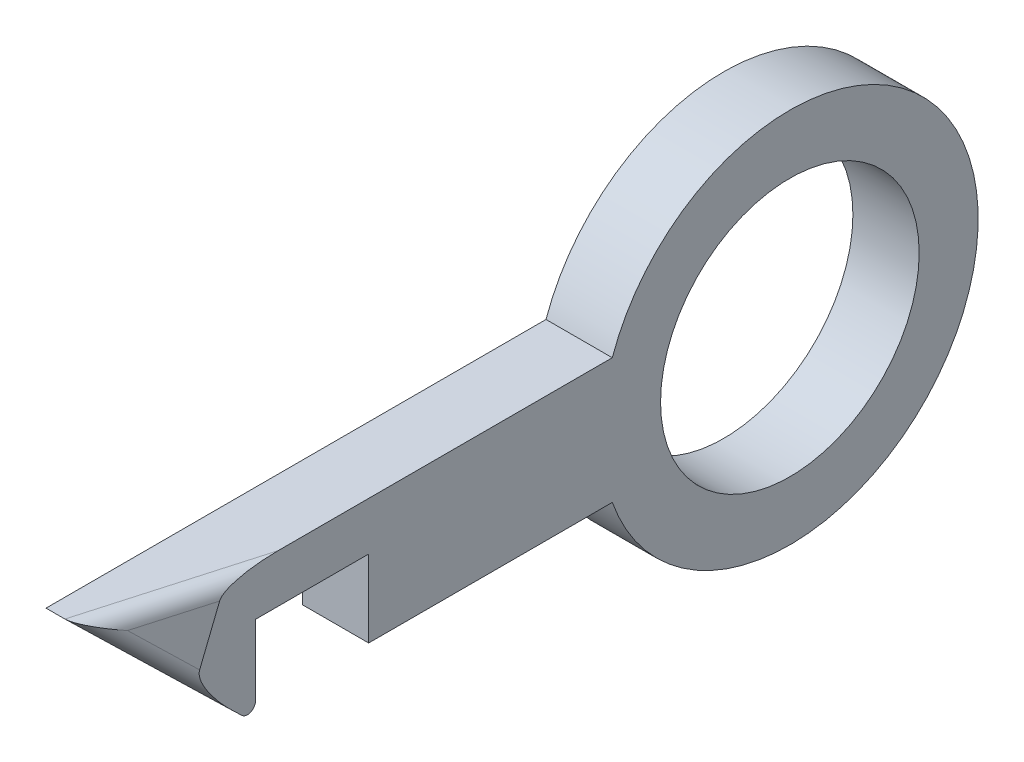
ISO-10303-21;
HEADER;
FILE_DESCRIPTION(('STEP AP214'),'2;1');
FILE_NAME('part.step','',(''),(''),'','','');
FILE_SCHEMA(('AUTOMOTIVE_DESIGN { 1 0 10303 214 1 1 1 1 }'));
ENDSEC;
DATA;
#1=APPLICATION_CONTEXT('core data for automotive mechanical design processes');
#2=APPLICATION_PROTOCOL_DEFINITION('international standard','automotive_design',2000,#1);
#3=PRODUCT_CONTEXT('',#1,'mechanical');
#4=PRODUCT('Part','Part','',(#3));
#5=PRODUCT_RELATED_PRODUCT_CATEGORY('part','',(#4));
#6=PRODUCT_DEFINITION_FORMATION('','',#4);
#7=PRODUCT_DEFINITION_CONTEXT('part definition',#1,'design');
#8=PRODUCT_DEFINITION('design','',#6,#7);
#9=PRODUCT_DEFINITION_SHAPE('','',#8);
#10=(LENGTH_UNIT() NAMED_UNIT(*) SI_UNIT(.MILLI.,.METRE.));
#11=(NAMED_UNIT(*) PLANE_ANGLE_UNIT() SI_UNIT($,.RADIAN.));
#12=(NAMED_UNIT(*) SI_UNIT($,.STERADIAN.) SOLID_ANGLE_UNIT());
#13=UNCERTAINTY_MEASURE_WITH_UNIT(LENGTH_MEASURE(1.E-05),#10,'distance_accuracy_value','');
#14=(GEOMETRIC_REPRESENTATION_CONTEXT(3) GLOBAL_UNCERTAINTY_ASSIGNED_CONTEXT((#13)) GLOBAL_UNIT_ASSIGNED_CONTEXT((#10,
#11,#12)) REPRESENTATION_CONTEXT('',''));
#15=CARTESIAN_POINT('',(0.,0.,0.));
#16=DIRECTION('',(0.,0.,1.));
#17=DIRECTION('',(1.,0.,0.));
#18=AXIS2_PLACEMENT_3D('',#15,#16,#17);
#19=CARTESIAN_POINT('',(4.1,4.64490969657858,-33.048252553421));
#20=DIRECTION('',(1.,0.,0.));
#21=DIRECTION('',(0.,0.,-1.));
#22=AXIS2_PLACEMENT_3D('',#19,#20,#21);
#23=PLANE('',#22);
#24=CARTESIAN_POINT('',(4.1,4.64490969657858,-33.048252553421));
#25=DIRECTION('',(1.,0.,0.));
#26=DIRECTION('',(0.,0.,-1.));
#27=AXIS2_PLACEMENT_3D('',#24,#25,#26);
#28=CIRCLE('',#27,8.);
#29=CARTESIAN_POINT('',(4.1,4.64490969657858,-41.048252553421));
#30=VERTEX_POINT('',#29);
#31=EDGE_CURVE('E238',#30,#30,#28,.T.);
#32=ORIENTED_EDGE('',*,*,#31,.F.);
#33=EDGE_LOOP('',(#32));
#34=FACE_BOUND('',#33,.T.);
#35=DIRECTION('',(0.,0.,1.));
#36=VECTOR('',#35,1.);
#37=CARTESIAN_POINT('',(4.1,8.51930515444542,8.86983730130517));
#38=LINE('',#37,#36);
#39=CARTESIAN_POINT('',(4.1,8.51930515444542,-22.061371292751));
#40=VERTEX_POINT('',#39);
#41=CARTESIAN_POINT('',(4.1,8.51930515444542,-1.38971479190022));
#42=VERTEX_POINT('',#41);
#43=EDGE_CURVE('E172',#40,#42,#38,.T.);
#44=ORIENTED_EDGE('',*,*,#43,.T.);
#45=CARTESIAN_POINT('',(4.1,7.51930515444542,-1.38971479190021));
#46=DIRECTION('',(1.,0.,0.));
#47=DIRECTION('',(0.,0.,-1.));
#48=AXIS2_PLACEMENT_3D('',#45,#46,#47);
#49=ELLIPSE('',#48,3.64005494464026,1.);
#50=CARTESIAN_POINT('',(4.1,7.62926768246086,2.22826588967206));
#51=VERTEX_POINT('',#50);
#52=EDGE_CURVE('E51',#42,#51,#49,.T.);
#53=ORIENTED_EDGE('',*,*,#52,.T.);
#54=DIRECTION('',(0.,-0.927606751707262,0.373558180458014));
#55=VECTOR('',#54,1.);
#56=CARTESIAN_POINT('',(4.1,17.2852100385916,-1.66029599339408));
#57=LINE('',#56,#55);
#58=CARTESIAN_POINT('',(4.1,4.55813136155333,3.46504871155776));
#59=VERTEX_POINT('',#58);
#60=EDGE_CURVE('E159',#51,#59,#57,.T.);
#61=ORIENTED_EDGE('',*,*,#60,.T.);
#62=CARTESIAN_POINT('',(4.1,2.13003448505021,0.780608075575374));
#63=DIRECTION('',(1.,0.,0.));
#64=DIRECTION('',(0.,0.693030180696668,0.720908571625795));
#65=AXIS2_PLACEMENT_3D('',#62,#63,#64);
#66=ELLIPSE('',#65,3.64005494464026,1.);
#67=CARTESIAN_POINT('',(4.1,1.40912591342442,1.47363825627204));
#68=VERTEX_POINT('',#67);
#69=EDGE_CURVE('E58',#59,#68,#66,.T.);
#70=ORIENTED_EDGE('',*,*,#69,.T.);
#71=DIRECTION('',(0.,-0.693030180696668,-0.720908571625795));
#72=VECTOR('',#71,1.);
#73=CARTESIAN_POINT('',(4.1,0.000360070989405065,0.00820226298800781));
#74=LINE('',#73,#72);
#75=CARTESIAN_POINT('',(4.1,0.814139417104715,0.854717353336342));
#76=VERTEX_POINT('',#75);
#77=EDGE_CURVE('E245',#68,#76,#74,.T.);
#78=ORIENTED_EDGE('',*,*,#77,.T.);
#79=CARTESIAN_POINT('',(4.1,1.17459370291761,0.508202262988008));
#80=DIRECTION('',(1.,0.,0.));
#81=DIRECTION('',(0.,0.,-1.));
#82=AXIS2_PLACEMENT_3D('',#79,#80,#81);
#83=CIRCLE('',#82,0.5);
#84=CARTESIAN_POINT('',(4.1,1.17459370291761,0.00820226298800795));
#85=VERTEX_POINT('',#84);
#86=EDGE_CURVE('E126',#76,#85,#83,.T.);
#87=ORIENTED_EDGE('',*,*,#86,.T.);
#88=DIRECTION('',(0.,1.,0.));
#89=VECTOR('',#88,1.);
#90=CARTESIAN_POINT('',(4.1,5.53817988011676,0.00820226298800848));
#91=LINE('',#90,#89);
#92=CARTESIAN_POINT('',(4.1,5.53817988011676,0.00820226298800848));
#93=VERTEX_POINT('',#92);
#94=EDGE_CURVE('E120',#85,#93,#91,.T.);
#95=ORIENTED_EDGE('',*,*,#94,.T.);
#96=DIRECTION('',(0.,0.,-1.));
#97=VECTOR('',#96,1.);
#98=CARTESIAN_POINT('',(4.1,5.53817988011676,-6.99179773701199));
#99=LINE('',#98,#97);
#100=CARTESIAN_POINT('',(4.1,5.53817988011676,-6.99179773701199));
#101=VERTEX_POINT('',#100);
#102=EDGE_CURVE('E123',#93,#101,#99,.T.);
#103=ORIENTED_EDGE('',*,*,#102,.T.);
#104=DIRECTION('',(0.,-1.,0.));
#105=VECTOR('',#104,1.);
#106=CARTESIAN_POINT('',(4.1,5.53817988011676,-6.99179773701199));
#107=LINE('',#106,#105);
#108=CARTESIAN_POINT('',(4.1,0.769305154445424,-6.99179773701199));
#109=VERTEX_POINT('',#108);
#110=EDGE_CURVE('E140',#101,#109,#107,.T.);
#111=ORIENTED_EDGE('',*,*,#110,.T.);
#112=DIRECTION('',(0.,0.,-1.));
#113=VECTOR('',#112,1.);
#114=CARTESIAN_POINT('',(4.1,0.769305154445424,-6.99179773701199));
#115=LINE('',#114,#113);
#116=CARTESIAN_POINT('',(4.1,0.769305154445428,-22.061797737012));
#117=VERTEX_POINT('',#116);
#118=EDGE_CURVE('E269',#109,#117,#115,.T.);
#119=ORIENTED_EDGE('',*,*,#118,.T.);
#120=CARTESIAN_POINT('',(4.1,4.64490969657858,-33.048252553421));
#121=DIRECTION('',(1.,0.,0.));
#122=DIRECTION('',(0.,0.,-1.));
#123=AXIS2_PLACEMENT_3D('',#120,#121,#122);
#124=CIRCLE('',#123,11.65);
#125=EDGE_CURVE('E274',#117,#40,#124,.T.);
#126=ORIENTED_EDGE('',*,*,#125,.T.);
#127=EDGE_LOOP('',(#44,#53,#61,#70,#78,#87,#95,#103,#111,#119,#126));
#128=FACE_BOUND('',#127,.T.);
#129=ADVANCED_FACE('F42',(#34,#128),#23,.T.);
#130=CARTESIAN_POINT('',(0.,4.64490969657858,-33.048252553421));
#131=DIRECTION('',(1.,0.,0.));
#132=DIRECTION('',(0.,0.,-1.));
#133=AXIS2_PLACEMENT_3D('',#130,#131,#132);
#134=PLANE('',#133);
#135=DIRECTION('',(0.,1.,0.));
#136=VECTOR('',#135,1.);
#137=CARTESIAN_POINT('',(0.,5.53817988011676,0.00820226298800848));
#138=LINE('',#137,#136);
#139=CARTESIAN_POINT('',(0.,1.17459370291761,0.00820226298800795));
#140=VERTEX_POINT('',#139);
#141=CARTESIAN_POINT('',(0.,5.53817988011676,0.00820226298800848));
#142=VERTEX_POINT('',#141);
#143=EDGE_CURVE('E144',#140,#142,#138,.T.);
#144=ORIENTED_EDGE('',*,*,#143,.F.);
#145=CARTESIAN_POINT('',(0.,1.17459370291761,0.508202262988008));
#146=DIRECTION('',(1.,0.,0.));
#147=DIRECTION('',(0.,0.,-1.));
#148=AXIS2_PLACEMENT_3D('',#145,#146,#147);
#149=CIRCLE('',#148,0.5);
#150=CARTESIAN_POINT('',(0.,0.814139417104715,0.854717353336342));
#151=VERTEX_POINT('',#150);
#152=EDGE_CURVE('E148',#140,#151,#149,.F.);
#153=ORIENTED_EDGE('',*,*,#152,.T.);
#154=DIRECTION('',(0.,-0.693030180696668,-0.720908571625795));
#155=VECTOR('',#154,1.);
#156=CARTESIAN_POINT('',(0.,0.000360070989405065,0.00820226298800781));
#157=LINE('',#156,#155);
#158=CARTESIAN_POINT('',(0.,8.51930515444542,8.86983730130517));
#159=VERTEX_POINT('',#158);
#160=EDGE_CURVE('E131',#159,#151,#157,.T.);
#161=ORIENTED_EDGE('',*,*,#160,.F.);
#162=DIRECTION('',(0.,0.,1.));
#163=VECTOR('',#162,1.);
#164=CARTESIAN_POINT('',(0.,8.51930515444542,8.86983730130517));
#165=LINE('',#164,#163);
#166=CARTESIAN_POINT('',(0.,8.51930515444542,-22.061371292751));
#167=VERTEX_POINT('',#166);
#168=EDGE_CURVE('E253',#167,#159,#165,.T.);
#169=ORIENTED_EDGE('',*,*,#168,.F.);
#170=CARTESIAN_POINT('',(0.,4.64490969657858,-33.048252553421));
#171=DIRECTION('',(1.,0.,0.));
#172=DIRECTION('',(0.,0.,-1.));
#173=AXIS2_PLACEMENT_3D('',#170,#171,#172);
#174=CIRCLE('',#173,11.65);
#175=CARTESIAN_POINT('',(0.,0.769305154445428,-22.061797737012));
#176=VERTEX_POINT('',#175);
#177=EDGE_CURVE('E251',#176,#167,#174,.T.);
#178=ORIENTED_EDGE('',*,*,#177,.F.);
#179=DIRECTION('',(0.,0.,-1.));
#180=VECTOR('',#179,1.);
#181=CARTESIAN_POINT('',(0.,0.769305154445424,-6.99179773701199));
#182=LINE('',#181,#180);
#183=CARTESIAN_POINT('',(0.,0.769305154445424,-6.99179773701199));
#184=VERTEX_POINT('',#183);
#185=EDGE_CURVE('E249',#184,#176,#182,.T.);
#186=ORIENTED_EDGE('',*,*,#185,.F.);
#187=DIRECTION('',(0.,-1.,0.));
#188=VECTOR('',#187,1.);
#189=CARTESIAN_POINT('',(0.,5.53817988011676,-6.99179773701199));
#190=LINE('',#189,#188);
#191=CARTESIAN_POINT('',(0.,5.53817988011676,-6.99179773701199));
#192=VERTEX_POINT('',#191);
#193=EDGE_CURVE('E240',#192,#184,#190,.T.);
#194=ORIENTED_EDGE('',*,*,#193,.F.);
#195=DIRECTION('',(0.,0.,-1.));
#196=VECTOR('',#195,1.);
#197=CARTESIAN_POINT('',(0.,5.53817988011676,-6.99179773701199));
#198=LINE('',#197,#196);
#199=EDGE_CURVE('E237',#142,#192,#198,.T.);
#200=ORIENTED_EDGE('',*,*,#199,.F.);
#201=EDGE_LOOP('',(#144,#153,#161,#169,#178,#186,#194,#200));
#202=FACE_BOUND('',#201,.T.);
#203=CARTESIAN_POINT('',(0.,4.64490969657858,-33.048252553421));
#204=DIRECTION('',(1.,0.,0.));
#205=DIRECTION('',(0.,0.,-1.));
#206=AXIS2_PLACEMENT_3D('',#203,#204,#205);
#207=CIRCLE('',#206,8.);
#208=CARTESIAN_POINT('',(0.,4.64490969657858,-41.048252553421));
#209=VERTEX_POINT('',#208);
#210=EDGE_CURVE('E182',#209,#209,#207,.T.);
#211=ORIENTED_EDGE('',*,*,#210,.T.);
#212=EDGE_LOOP('',(#211));
#213=FACE_BOUND('',#212,.T.);
#214=ADVANCED_FACE('F191',(#202,#213),#134,.F.);
#215=CARTESIAN_POINT('',(4.1,5.53817988011676,0.00820226298800848));
#216=DIRECTION('',(0.,0.,1.));
#217=DIRECTION('',(0.,-1.,0.));
#218=AXIS2_PLACEMENT_3D('',#215,#216,#217);
#219=PLANE('',#218);
#220=ORIENTED_EDGE('',*,*,#94,.F.);
#221=DIRECTION('',(-1.,0.,0.));
#222=VECTOR('',#221,1.);
#223=CARTESIAN_POINT('',(4.1,1.17459370291761,0.00820226298800795));
#224=LINE('',#223,#222);
#225=EDGE_CURVE('E146',#85,#140,#224,.T.);
#226=ORIENTED_EDGE('',*,*,#225,.T.);
#227=ORIENTED_EDGE('',*,*,#143,.T.);
#228=DIRECTION('',(-1.,0.,0.));
#229=VECTOR('',#228,1.);
#230=CARTESIAN_POINT('',(4.1,5.53817988011676,0.00820226298800848));
#231=LINE('',#230,#229);
#232=EDGE_CURVE('E136',#93,#142,#231,.T.);
#233=ORIENTED_EDGE('',*,*,#232,.F.);
#234=EDGE_LOOP('',(#220,#226,#227,#233));
#235=FACE_BOUND('',#234,.T.);
#236=ADVANCED_FACE('F142',(#235),#219,.F.);
#237=CARTESIAN_POINT('',(4.1,5.53817988011676,-6.99179773701199));
#238=DIRECTION('',(0.,1.,0.));
#239=DIRECTION('',(0.,0.,1.));
#240=AXIS2_PLACEMENT_3D('',#237,#238,#239);
#241=PLANE('',#240);
#242=ORIENTED_EDGE('',*,*,#199,.T.);
#243=DIRECTION('',(-1.,0.,0.));
#244=VECTOR('',#243,1.);
#245=CARTESIAN_POINT('',(4.1,5.53817988011676,-6.99179773701199));
#246=LINE('',#245,#244);
#247=EDGE_CURVE('E138',#101,#192,#246,.T.);
#248=ORIENTED_EDGE('',*,*,#247,.F.);
#249=ORIENTED_EDGE('',*,*,#102,.F.);
#250=ORIENTED_EDGE('',*,*,#232,.T.);
#251=EDGE_LOOP('',(#242,#248,#249,#250));
#252=FACE_BOUND('',#251,.T.);
#253=ADVANCED_FACE('F135',(#252),#241,.F.);
#254=CARTESIAN_POINT('',(4.1,5.53817988011676,-6.99179773701199));
#255=DIRECTION('',(0.,0.,-1.));
#256=DIRECTION('',(0.,1.,0.));
#257=AXIS2_PLACEMENT_3D('',#254,#255,#256);
#258=PLANE('',#257);
#259=ORIENTED_EDGE('',*,*,#193,.T.);
#260=DIRECTION('',(-1.,0.,0.));
#261=VECTOR('',#260,1.);
#262=CARTESIAN_POINT('',(4.1,0.769305154445424,-6.99179773701199));
#263=LINE('',#262,#261);
#264=EDGE_CURVE('E150',#109,#184,#263,.T.);
#265=ORIENTED_EDGE('',*,*,#264,.F.);
#266=ORIENTED_EDGE('',*,*,#110,.F.);
#267=ORIENTED_EDGE('',*,*,#247,.T.);
#268=EDGE_LOOP('',(#259,#265,#266,#267));
#269=FACE_BOUND('',#268,.T.);
#270=ADVANCED_FACE('F217',(#269),#258,.F.);
#271=CARTESIAN_POINT('',(4.1,0.769305154445424,-6.99179773701199));
#272=DIRECTION('',(0.,1.,0.));
#273=DIRECTION('',(0.,0.,1.));
#274=AXIS2_PLACEMENT_3D('',#271,#272,#273);
#275=PLANE('',#274);
#276=ORIENTED_EDGE('',*,*,#185,.T.);
#277=DIRECTION('',(-1.,0.,0.));
#278=VECTOR('',#277,1.);
#279=CARTESIAN_POINT('',(4.1,0.769305154445428,-22.061797737012));
#280=LINE('',#279,#278);
#281=EDGE_CURVE('E262',#117,#176,#280,.T.);
#282=ORIENTED_EDGE('',*,*,#281,.F.);
#283=ORIENTED_EDGE('',*,*,#118,.F.);
#284=ORIENTED_EDGE('',*,*,#264,.T.);
#285=EDGE_LOOP('',(#276,#282,#283,#284));
#286=FACE_BOUND('',#285,.T.);
#287=ADVANCED_FACE('F213',(#286),#275,.F.);
#288=CARTESIAN_POINT('',(4.1,4.64490969657858,-33.048252553421));
#289=DIRECTION('',(-1.,0.,0.));
#290=DIRECTION('',(0.,0.,1.));
#291=AXIS2_PLACEMENT_3D('',#288,#289,#290);
#292=CYLINDRICAL_SURFACE('',#291,11.65);
#293=ORIENTED_EDGE('',*,*,#177,.T.);
#294=DIRECTION('',(-1.,0.,0.));
#295=VECTOR('',#294,1.);
#296=CARTESIAN_POINT('',(4.1,8.51930515444542,-22.061371292751));
#297=LINE('',#296,#295);
#298=EDGE_CURVE('E259',#40,#167,#297,.T.);
#299=ORIENTED_EDGE('',*,*,#298,.F.);
#300=ORIENTED_EDGE('',*,*,#125,.F.);
#301=ORIENTED_EDGE('',*,*,#281,.T.);
#302=EDGE_LOOP('',(#293,#299,#300,#301));
#303=FACE_BOUND('',#302,.T.);
#304=ADVANCED_FACE('F209',(#303),#292,.T.);
#305=CARTESIAN_POINT('',(4.1,8.51930515444542,8.86983730130517));
#306=DIRECTION('',(0.,-1.,0.));
#307=DIRECTION('',(0.,0.,-1.));
#308=AXIS2_PLACEMENT_3D('',#305,#306,#307);
#309=PLANE('',#308);
#310=DIRECTION('',(-1.,0.,0.));
#311=VECTOR('',#310,1.);
#312=CARTESIAN_POINT('',(4.1,8.51930515444542,8.86983730130517));
#313=LINE('',#312,#311);
#314=CARTESIAN_POINT('',(1.16869940194132,8.51930515444542,8.86983730130517));
#315=VERTEX_POINT('',#314);
#316=EDGE_CURVE('E257',#315,#159,#313,.T.);
#317=ORIENTED_EDGE('',*,*,#316,.F.);
#318=DIRECTION('',(-0.274721127897378,0.,0.961523947640823));
#319=VECTOR('',#318,1.);
#320=CARTESIAN_POINT('',(3.23898623953065,8.51930515444542,1.62383336974251));
#321=LINE('',#320,#319);
#322=EDGE_CURVE('E166',#315,#42,#321,.F.);
#323=ORIENTED_EDGE('',*,*,#322,.T.);
#324=ORIENTED_EDGE('',*,*,#43,.F.);
#325=ORIENTED_EDGE('',*,*,#298,.T.);
#326=ORIENTED_EDGE('',*,*,#168,.T.);
#327=EDGE_LOOP('',(#317,#323,#324,#325,#326));
#328=FACE_BOUND('',#327,.T.);
#329=ADVANCED_FACE('F206',(#328),#309,.F.);
#330=CARTESIAN_POINT('',(4.1,0.000360070989405065,0.00820226298800781));
#331=DIRECTION('',(0.,0.720908571625795,-0.693030180696668));
#332=DIRECTION('',(0.,0.693030180696668,0.720908571625795));
#333=AXIS2_PLACEMENT_3D('',#330,#331,#332);
#334=PLANE('',#333);
#335=ORIENTED_EDGE('',*,*,#77,.F.);
#336=DIRECTION('',(0.274721127897378,-0.666365115177693,-0.693170855677742));
#337=VECTOR('',#336,1.);
#338=CARTESIAN_POINT('',(1.23898623953065,8.34881700530246,8.692490958388));
#339=LINE('',#338,#337);
#340=EDGE_CURVE('E11',#68,#315,#339,.F.);
#341=ORIENTED_EDGE('',*,*,#340,.T.);
#342=ORIENTED_EDGE('',*,*,#316,.T.);
#343=ORIENTED_EDGE('',*,*,#160,.T.);
#344=DIRECTION('',(-1.,0.,0.));
#345=VECTOR('',#344,1.);
#346=CARTESIAN_POINT('',(4.1,0.814139417104715,0.854717353336342));
#347=LINE('',#346,#345);
#348=EDGE_CURVE('E155',#151,#76,#347,.F.);
#349=ORIENTED_EDGE('',*,*,#348,.T.);
#350=EDGE_LOOP('',(#335,#341,#342,#343,#349));
#351=FACE_BOUND('',#350,.T.);
#352=ADVANCED_FACE('F203',(#351),#334,.F.);
#353=CARTESIAN_POINT('',(4.1,4.64490969657858,-33.048252553421));
#354=DIRECTION('',(-1.,0.,0.));
#355=DIRECTION('',(0.,0.,1.));
#356=AXIS2_PLACEMENT_3D('',#353,#354,#355);
#357=CYLINDRICAL_SURFACE('',#356,8.);
#358=ORIENTED_EDGE('',*,*,#31,.T.);
#359=EDGE_LOOP('',(#358));
#360=FACE_BOUND('',#359,.T.);
#361=ORIENTED_EDGE('',*,*,#210,.F.);
#362=EDGE_LOOP('',(#361));
#363=FACE_BOUND('',#362,.T.);
#364=ADVANCED_FACE('F201',(#360,#363),#357,.F.);
#365=CARTESIAN_POINT('',(4.1,1.17459370291761,0.508202262988008));
#366=DIRECTION('',(-1.,0.,0.));
#367=DIRECTION('',(0.,0.,1.));
#368=AXIS2_PLACEMENT_3D('',#365,#366,#367);
#369=CYLINDRICAL_SURFACE('',#368,0.5);
#370=ORIENTED_EDGE('',*,*,#86,.F.);
#371=ORIENTED_EDGE('',*,*,#348,.F.);
#372=ORIENTED_EDGE('',*,*,#152,.F.);
#373=ORIENTED_EDGE('',*,*,#225,.F.);
#374=EDGE_LOOP('',(#370,#371,#372,#373));
#375=FACE_BOUND('',#374,.T.);
#376=ADVANCED_FACE('F188',(#375),#369,.T.);
#377=CARTESIAN_POINT('',(5.12797571879567,0.590027516793089,1.4651359196559));
#378=DIRECTION('',(0.955693010226633,0.109962528015434,0.273055145779038));
#379=DIRECTION('',(0.274721127897378,0.,-0.961523947640823));
#380=AXIS2_PLACEMENT_3D('',#377,#378,#379);
#381=PLANE('',#380);
#382=ORIENTED_EDGE('',*,*,#60,.F.);
#383=DIRECTION('',(-0.274721127897378,0.,0.961523947640823));
#384=VECTOR('',#383,1.);
#385=CARTESIAN_POINT('',(2.19467924975728,7.62926768246086,8.89688851552154));
#386=LINE('',#385,#384);
#387=CARTESIAN_POINT('',(2.83386824311573,7.62926768246086,6.659727038767));
#388=VERTEX_POINT('',#387);
#389=EDGE_CURVE('E163',#51,#388,#386,.T.);
#390=ORIENTED_EDGE('',*,*,#389,.T.);
#391=DIRECTION('',(0.274721127897378,-0.666365115177693,-0.693170855677742));
#392=VECTOR('',#391,1.);
#393=CARTESIAN_POINT('',(4.19467924975728,4.32847684006701,3.22615592208981));
#394=LINE('',#393,#392);
#395=EDGE_CURVE('E161',#388,#59,#394,.T.);
#396=ORIENTED_EDGE('',*,*,#395,.T.);
#397=EDGE_LOOP('',(#382,#390,#396));
#398=FACE_BOUND('',#397,.T.);
#399=ADVANCED_FACE('F177',(#398),#381,.T.);
#400=CARTESIAN_POINT('',(4.3291500625581,1.57420680263569,0.202421220571853));
#401=DIRECTION('',(-0.274721127897378,0.666365115177693,0.693170855677742));
#402=DIRECTION('',(0.,-0.720908571625795,0.693030180696668));
#403=AXIS2_PLACEMENT_3D('',#400,#401,#402);
#404=CYLINDRICAL_SURFACE('',#403,1.);
#405=ORIENTED_EDGE('',*,*,#69,.F.);
#406=ORIENTED_EDGE('',*,*,#395,.F.);
#407=CARTESIAN_POINT('',(1.87817523288909,7.51930515444542,6.38667189298795));
#408=DIRECTION('',(0.,0.927606751707262,-0.373558180458015));
#409=DIRECTION('',(-0.294365198697055,0.357006941976704,0.886507288845662));
#410=AXIS2_PLACEMENT_3D('',#407,#408,#409);
#411=ELLIPSE('',#410,2.78407957013148,1.);
#412=EDGE_CURVE('E46',#315,#388,#411,.T.);
#413=ORIENTED_EDGE('',*,*,#412,.F.);
#414=ORIENTED_EDGE('',*,*,#340,.F.);
#415=EDGE_LOOP('',(#405,#406,#413,#414));
#416=FACE_BOUND('',#415,.T.);
#417=ADVANCED_FACE('F44',(#416),#404,.T.);
#418=CARTESIAN_POINT('',(3.42347156440372,7.51930515444542,0.978134732686776));
#419=DIRECTION('',(0.274721127897378,0.,-0.961523947640823));
#420=DIRECTION('',(-0.961523947640823,0.,-0.274721127897378));
#421=AXIS2_PLACEMENT_3D('',#418,#419,#420);
#422=CYLINDRICAL_SURFACE('',#421,1.);
#423=ORIENTED_EDGE('',*,*,#52,.F.);
#424=ORIENTED_EDGE('',*,*,#322,.F.);
#425=ORIENTED_EDGE('',*,*,#412,.T.);
#426=ORIENTED_EDGE('',*,*,#389,.F.);
#427=EDGE_LOOP('',(#423,#424,#425,#426));
#428=FACE_BOUND('',#427,.T.);
#429=ADVANCED_FACE('F179',(#428),#422,.T.);
#430=CLOSED_SHELL('',(#129,#214,#236,#253,#270,#287,#304,#329,#352,#364,#376,#399,#417,#429));
#431=MANIFOLD_SOLID_BREP('B2',#430);
#432=ADVANCED_BREP_SHAPE_REPRESENTATION('',(#18,#431),#14);
#433=SHAPE_DEFINITION_REPRESENTATION(#9,#432);
ENDSEC;
END-ISO-10303-21;
